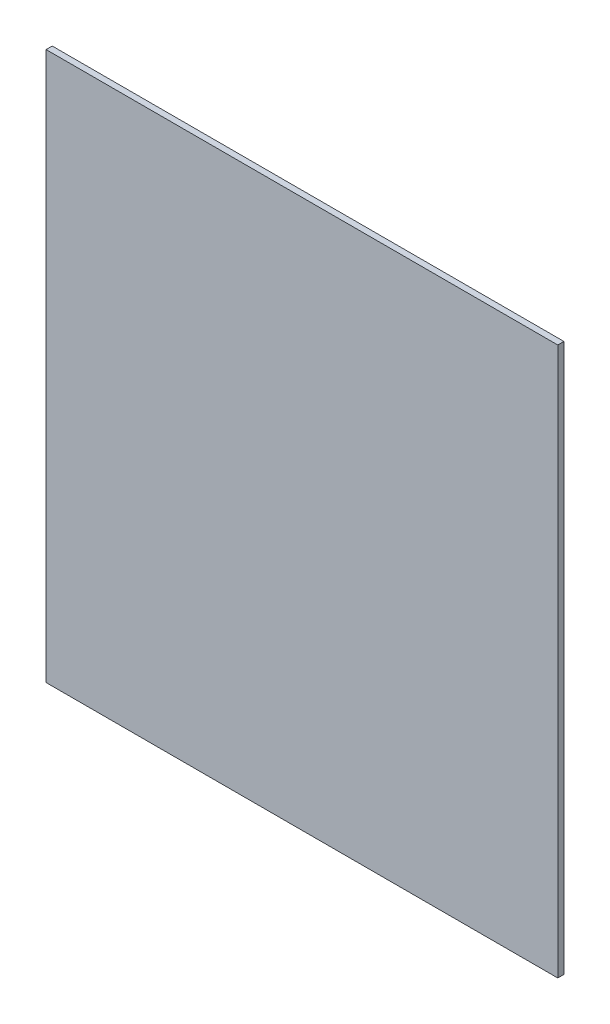
ISO-10303-21;
HEADER;
FILE_DESCRIPTION(('STEP AP214'),'2;1');
FILE_NAME('part.step','',(''),(''),'','','');
FILE_SCHEMA(('AUTOMOTIVE_DESIGN { 1 0 10303 214 1 1 1 1 }'));
ENDSEC;
DATA;
#1=APPLICATION_CONTEXT('core data for automotive mechanical design processes');
#2=APPLICATION_PROTOCOL_DEFINITION('international standard','automotive_design',2000,#1);
#3=PRODUCT_CONTEXT('',#1,'mechanical');
#4=PRODUCT('Part','Part','',(#3));
#5=PRODUCT_RELATED_PRODUCT_CATEGORY('part','',(#4));
#6=PRODUCT_DEFINITION_FORMATION('','',#4);
#7=PRODUCT_DEFINITION_CONTEXT('part definition',#1,'design');
#8=PRODUCT_DEFINITION('design','',#6,#7);
#9=PRODUCT_DEFINITION_SHAPE('','',#8);
#10=(LENGTH_UNIT() NAMED_UNIT(*) SI_UNIT(.MILLI.,.METRE.));
#11=(NAMED_UNIT(*) PLANE_ANGLE_UNIT() SI_UNIT($,.RADIAN.));
#12=(NAMED_UNIT(*) SI_UNIT($,.STERADIAN.) SOLID_ANGLE_UNIT());
#13=UNCERTAINTY_MEASURE_WITH_UNIT(LENGTH_MEASURE(1.E-05),#10,'distance_accuracy_value','');
#14=(GEOMETRIC_REPRESENTATION_CONTEXT(3) GLOBAL_UNCERTAINTY_ASSIGNED_CONTEXT((#13)) GLOBAL_UNIT_ASSIGNED_CONTEXT((#10,
#11,#12)) REPRESENTATION_CONTEXT('',''));
#15=CARTESIAN_POINT('',(0.,0.,0.));
#16=DIRECTION('',(0.,0.,1.));
#17=DIRECTION('',(1.,0.,0.));
#18=AXIS2_PLACEMENT_3D('',#15,#16,#17);
#19=CARTESIAN_POINT('',(0.,0.,3.));
#20=DIRECTION('',(1.,0.,0.));
#21=DIRECTION('',(0.,1.,0.));
#22=AXIS2_PLACEMENT_3D('',#19,#20,#21);
#23=PLANE('',#22);
#24=DIRECTION('',(0.,-1.,0.));
#25=VECTOR('',#24,1.);
#26=CARTESIAN_POINT('',(0.,0.,0.));
#27=LINE('',#26,#25);
#28=CARTESIAN_POINT('',(0.,0.,0.));
#29=VERTEX_POINT('',#28);
#30=CARTESIAN_POINT('',(0.,-267.4,0.));
#31=VERTEX_POINT('',#30);
#32=EDGE_CURVE('E96',#29,#31,#27,.T.);
#33=ORIENTED_EDGE('',*,*,#32,.T.);
#34=DIRECTION('',(0.,0.,-1.));
#35=VECTOR('',#34,1.);
#36=CARTESIAN_POINT('',(0.,-267.4,3.));
#37=LINE('',#36,#35);
#38=CARTESIAN_POINT('',(0.,-267.4,3.));
#39=VERTEX_POINT('',#38);
#40=EDGE_CURVE('E11',#39,#31,#37,.T.);
#41=ORIENTED_EDGE('',*,*,#40,.F.);
#42=DIRECTION('',(0.,-1.,0.));
#43=VECTOR('',#42,1.);
#44=CARTESIAN_POINT('',(0.,0.,3.));
#45=LINE('',#44,#43);
#46=CARTESIAN_POINT('',(0.,0.,3.));
#47=VERTEX_POINT('',#46);
#48=EDGE_CURVE('E84',#47,#39,#45,.T.);
#49=ORIENTED_EDGE('',*,*,#48,.F.);
#50=DIRECTION('',(0.,0.,-1.));
#51=VECTOR('',#50,1.);
#52=CARTESIAN_POINT('',(0.,0.,3.));
#53=LINE('',#52,#51);
#54=EDGE_CURVE('E92',#47,#29,#53,.T.);
#55=ORIENTED_EDGE('',*,*,#54,.T.);
#56=EDGE_LOOP('',(#33,#41,#49,#55));
#57=FACE_BOUND('',#56,.T.);
#58=ADVANCED_FACE('F33',(#57),#23,.F.);
#59=CARTESIAN_POINT('',(0.,-267.4,3.));
#60=DIRECTION('',(0.,1.,0.));
#61=DIRECTION('',(-1.,0.,0.));
#62=AXIS2_PLACEMENT_3D('',#59,#60,#61);
#63=PLANE('',#62);
#64=DIRECTION('',(1.,0.,0.));
#65=VECTOR('',#64,1.);
#66=CARTESIAN_POINT('',(0.,-267.4,0.));
#67=LINE('',#66,#65);
#68=CARTESIAN_POINT('',(249.6,-267.4,0.));
#69=VERTEX_POINT('',#68);
#70=EDGE_CURVE('E88',#31,#69,#67,.T.);
#71=ORIENTED_EDGE('',*,*,#70,.T.);
#72=DIRECTION('',(0.,0.,-1.));
#73=VECTOR('',#72,1.);
#74=CARTESIAN_POINT('',(249.6,-267.4,3.));
#75=LINE('',#74,#73);
#76=CARTESIAN_POINT('',(249.6,-267.4,3.));
#77=VERTEX_POINT('',#76);
#78=EDGE_CURVE('E41',#77,#69,#75,.T.);
#79=ORIENTED_EDGE('',*,*,#78,.F.);
#80=DIRECTION('',(1.,0.,0.));
#81=VECTOR('',#80,1.);
#82=CARTESIAN_POINT('',(0.,-267.4,3.));
#83=LINE('',#82,#81);
#84=EDGE_CURVE('E79',#39,#77,#83,.T.);
#85=ORIENTED_EDGE('',*,*,#84,.F.);
#86=ORIENTED_EDGE('',*,*,#40,.T.);
#87=EDGE_LOOP('',(#71,#79,#85,#86));
#88=FACE_BOUND('',#87,.T.);
#89=ADVANCED_FACE('F87',(#88),#63,.F.);
#90=CARTESIAN_POINT('',(249.6,0.,3.));
#91=DIRECTION('',(-1.,0.,0.));
#92=DIRECTION('',(0.,-1.,0.));
#93=AXIS2_PLACEMENT_3D('',#90,#91,#92);
#94=PLANE('',#93);
#95=DIRECTION('',(0.,1.,0.));
#96=VECTOR('',#95,1.);
#97=CARTESIAN_POINT('',(249.6,0.,0.));
#98=LINE('',#97,#96);
#99=CARTESIAN_POINT('',(249.6,0.,0.));
#100=VERTEX_POINT('',#99);
#101=EDGE_CURVE('E66',#69,#100,#98,.T.);
#102=ORIENTED_EDGE('',*,*,#101,.T.);
#103=DIRECTION('',(0.,0.,-1.));
#104=VECTOR('',#103,1.);
#105=CARTESIAN_POINT('',(249.6,0.,3.));
#106=LINE('',#105,#104);
#107=CARTESIAN_POINT('',(249.6,0.,3.));
#108=VERTEX_POINT('',#107);
#109=EDGE_CURVE('E89',#108,#100,#106,.T.);
#110=ORIENTED_EDGE('',*,*,#109,.F.);
#111=DIRECTION('',(0.,1.,0.));
#112=VECTOR('',#111,1.);
#113=CARTESIAN_POINT('',(249.6,0.,3.));
#114=LINE('',#113,#112);
#115=EDGE_CURVE('E82',#77,#108,#114,.T.);
#116=ORIENTED_EDGE('',*,*,#115,.F.);
#117=ORIENTED_EDGE('',*,*,#78,.T.);
#118=EDGE_LOOP('',(#102,#110,#116,#117));
#119=FACE_BOUND('',#118,.T.);
#120=ADVANCED_FACE('F90',(#119),#94,.F.);
#121=CARTESIAN_POINT('',(0.,0.,3.));
#122=DIRECTION('',(0.,-1.,0.));
#123=DIRECTION('',(0.,0.,-1.));
#124=AXIS2_PLACEMENT_3D('',#121,#122,#123);
#125=PLANE('',#124);
#126=DIRECTION('',(-1.,0.,0.));
#127=VECTOR('',#126,1.);
#128=CARTESIAN_POINT('',(0.,0.,0.));
#129=LINE('',#128,#127);
#130=EDGE_CURVE('E72',#100,#29,#129,.T.);
#131=ORIENTED_EDGE('',*,*,#130,.T.);
#132=ORIENTED_EDGE('',*,*,#54,.F.);
#133=DIRECTION('',(-1.,0.,0.));
#134=VECTOR('',#133,1.);
#135=CARTESIAN_POINT('',(0.,0.,3.));
#136=LINE('',#135,#134);
#137=EDGE_CURVE('E49',#108,#47,#136,.T.);
#138=ORIENTED_EDGE('',*,*,#137,.F.);
#139=ORIENTED_EDGE('',*,*,#109,.T.);
#140=EDGE_LOOP('',(#131,#132,#138,#139));
#141=FACE_BOUND('',#140,.T.);
#142=ADVANCED_FACE('F103',(#141),#125,.F.);
#143=CARTESIAN_POINT('',(0.,0.,3.));
#144=DIRECTION('',(0.,0.,1.));
#145=DIRECTION('',(1.,0.,0.));
#146=AXIS2_PLACEMENT_3D('',#143,#144,#145);
#147=PLANE('',#146);
#148=ORIENTED_EDGE('',*,*,#48,.T.);
#149=ORIENTED_EDGE('',*,*,#84,.T.);
#150=ORIENTED_EDGE('',*,*,#115,.T.);
#151=ORIENTED_EDGE('',*,*,#137,.T.);
#152=EDGE_LOOP('',(#148,#149,#150,#151));
#153=FACE_BOUND('',#152,.T.);
#154=ADVANCED_FACE('F80',(#153),#147,.T.);
#155=CARTESIAN_POINT('',(0.,0.,0.));
#156=DIRECTION('',(0.,0.,1.));
#157=DIRECTION('',(1.,0.,0.));
#158=AXIS2_PLACEMENT_3D('',#155,#156,#157);
#159=PLANE('',#158);
#160=ORIENTED_EDGE('',*,*,#32,.F.);
#161=ORIENTED_EDGE('',*,*,#130,.F.);
#162=ORIENTED_EDGE('',*,*,#101,.F.);
#163=ORIENTED_EDGE('',*,*,#70,.F.);
#164=EDGE_LOOP('',(#160,#161,#162,#163));
#165=FACE_BOUND('',#164,.T.);
#166=ADVANCED_FACE('F106',(#165),#159,.F.);
#167=CLOSED_SHELL('',(#58,#89,#120,#142,#154,#166));
#168=MANIFOLD_SOLID_BREP('B2',#167);
#169=ADVANCED_BREP_SHAPE_REPRESENTATION('',(#18,#168),#14);
#170=SHAPE_DEFINITION_REPRESENTATION(#9,#169);
ENDSEC;
END-ISO-10303-21;
